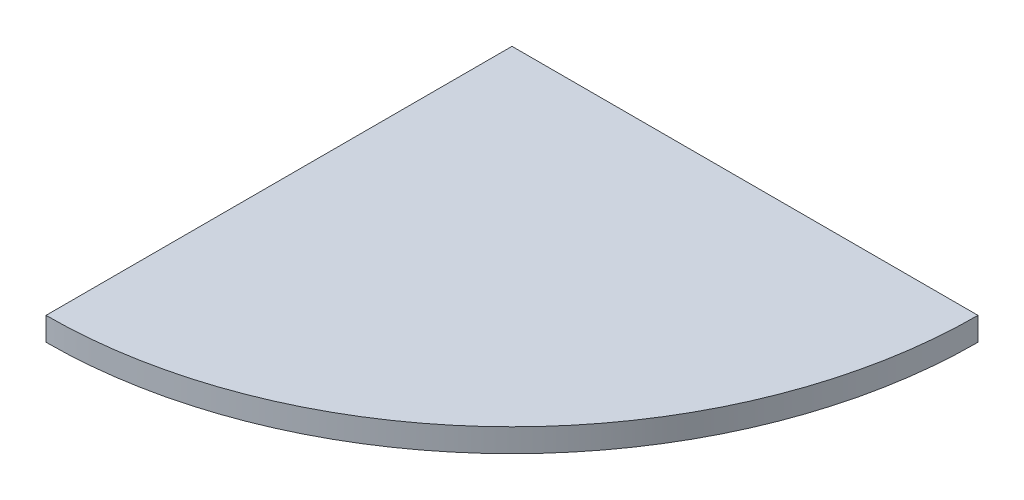
ISO-10303-21;
HEADER;
FILE_DESCRIPTION(('STEP AP214'),'2;1');
FILE_NAME('part.step','',(''),(''),'','','');
FILE_SCHEMA(('AUTOMOTIVE_DESIGN { 1 0 10303 214 1 1 1 1 }'));
ENDSEC;
DATA;
#1=APPLICATION_CONTEXT('core data for automotive mechanical design processes');
#2=APPLICATION_PROTOCOL_DEFINITION('international standard','automotive_design',2000,#1);
#3=PRODUCT_CONTEXT('',#1,'mechanical');
#4=PRODUCT('Part','Part','',(#3));
#5=PRODUCT_RELATED_PRODUCT_CATEGORY('part','',(#4));
#6=PRODUCT_DEFINITION_FORMATION('','',#4);
#7=PRODUCT_DEFINITION_CONTEXT('part definition',#1,'design');
#8=PRODUCT_DEFINITION('design','',#6,#7);
#9=PRODUCT_DEFINITION_SHAPE('','',#8);
#10=(LENGTH_UNIT() NAMED_UNIT(*) SI_UNIT(.MILLI.,.METRE.));
#11=(NAMED_UNIT(*) PLANE_ANGLE_UNIT() SI_UNIT($,.RADIAN.));
#12=(NAMED_UNIT(*) SI_UNIT($,.STERADIAN.) SOLID_ANGLE_UNIT());
#13=UNCERTAINTY_MEASURE_WITH_UNIT(LENGTH_MEASURE(1.E-05),#10,'distance_accuracy_value','');
#14=(GEOMETRIC_REPRESENTATION_CONTEXT(3) GLOBAL_UNCERTAINTY_ASSIGNED_CONTEXT((#13)) GLOBAL_UNIT_ASSIGNED_CONTEXT((#10,
#11,#12)) REPRESENTATION_CONTEXT('',''));
#15=CARTESIAN_POINT('',(0.,0.,0.));
#16=DIRECTION('',(0.,0.,1.));
#17=DIRECTION('',(1.,0.,0.));
#18=AXIS2_PLACEMENT_3D('',#15,#16,#17);
#19=CARTESIAN_POINT('',(0.,15.24,0.));
#20=DIRECTION('',(1.,0.,0.));
#21=DIRECTION('',(0.,0.,-1.));
#22=AXIS2_PLACEMENT_3D('',#19,#20,#21);
#23=PLANE('',#22);
#24=DIRECTION('',(0.,0.,1.));
#25=VECTOR('',#24,1.);
#26=CARTESIAN_POINT('',(0.,-15.24,0.));
#27=LINE('',#26,#25);
#28=CARTESIAN_POINT('',(0.,-15.24,0.));
#29=VERTEX_POINT('',#28);
#30=CARTESIAN_POINT('',(0.,-15.24,609.6));
#31=VERTEX_POINT('',#30);
#32=EDGE_CURVE('E93',#29,#31,#27,.T.);
#33=ORIENTED_EDGE('',*,*,#32,.T.);
#34=DIRECTION('',(0.,-1.,0.));
#35=VECTOR('',#34,1.);
#36=CARTESIAN_POINT('',(0.,15.24,609.6));
#37=LINE('',#36,#35);
#38=CARTESIAN_POINT('',(0.,15.24,609.6));
#39=VERTEX_POINT('',#38);
#40=EDGE_CURVE('E11',#39,#31,#37,.T.);
#41=ORIENTED_EDGE('',*,*,#40,.F.);
#42=DIRECTION('',(0.,0.,1.));
#43=VECTOR('',#42,1.);
#44=CARTESIAN_POINT('',(0.,15.24,0.));
#45=LINE('',#44,#43);
#46=CARTESIAN_POINT('',(0.,15.24,0.));
#47=VERTEX_POINT('',#46);
#48=EDGE_CURVE('E85',#47,#39,#45,.T.);
#49=ORIENTED_EDGE('',*,*,#48,.F.);
#50=DIRECTION('',(0.,-1.,0.));
#51=VECTOR('',#50,1.);
#52=CARTESIAN_POINT('',(0.,15.24,0.));
#53=LINE('',#52,#51);
#54=EDGE_CURVE('E94',#47,#29,#53,.T.);
#55=ORIENTED_EDGE('',*,*,#54,.T.);
#56=EDGE_LOOP('',(#33,#41,#49,#55));
#57=FACE_BOUND('',#56,.T.);
#58=ADVANCED_FACE('F43',(#57),#23,.F.);
#59=CARTESIAN_POINT('',(0.,15.24,0.));
#60=DIRECTION('',(0.,-1.,0.));
#61=DIRECTION('',(0.,0.,-1.));
#62=AXIS2_PLACEMENT_3D('',#59,#60,#61);
#63=CYLINDRICAL_SURFACE('',#62,609.6);
#64=CARTESIAN_POINT('',(0.,-15.24,0.));
#65=DIRECTION('',(0.,1.,0.));
#66=DIRECTION('',(0.,0.,1.));
#67=AXIS2_PLACEMENT_3D('',#64,#65,#66);
#68=CIRCLE('',#67,609.6);
#69=CARTESIAN_POINT('',(609.6,-15.24,0.));
#70=VERTEX_POINT('',#69);
#71=EDGE_CURVE('E72',#31,#70,#68,.T.);
#72=ORIENTED_EDGE('',*,*,#71,.T.);
#73=DIRECTION('',(0.,-1.,0.));
#74=VECTOR('',#73,1.);
#75=CARTESIAN_POINT('',(609.6,15.24,0.));
#76=LINE('',#75,#74);
#77=CARTESIAN_POINT('',(609.6,15.24,0.));
#78=VERTEX_POINT('',#77);
#79=EDGE_CURVE('E52',#78,#70,#76,.T.);
#80=ORIENTED_EDGE('',*,*,#79,.F.);
#81=CARTESIAN_POINT('',(0.,15.24,0.));
#82=DIRECTION('',(0.,1.,0.));
#83=DIRECTION('',(0.,0.,1.));
#84=AXIS2_PLACEMENT_3D('',#81,#82,#83);
#85=CIRCLE('',#84,609.6);
#86=EDGE_CURVE('E80',#39,#78,#85,.T.);
#87=ORIENTED_EDGE('',*,*,#86,.F.);
#88=ORIENTED_EDGE('',*,*,#40,.T.);
#89=EDGE_LOOP('',(#72,#80,#87,#88));
#90=FACE_BOUND('',#89,.T.);
#91=ADVANCED_FACE('F81',(#90),#63,.T.);
#92=CARTESIAN_POINT('',(0.,15.24,0.));
#93=DIRECTION('',(0.,0.,1.));
#94=DIRECTION('',(1.,0.,0.));
#95=AXIS2_PLACEMENT_3D('',#92,#93,#94);
#96=PLANE('',#95);
#97=DIRECTION('',(-1.,0.,0.));
#98=VECTOR('',#97,1.);
#99=CARTESIAN_POINT('',(0.,-15.24,0.));
#100=LINE('',#99,#98);
#101=EDGE_CURVE('E77',#70,#29,#100,.T.);
#102=ORIENTED_EDGE('',*,*,#101,.T.);
#103=ORIENTED_EDGE('',*,*,#54,.F.);
#104=DIRECTION('',(-1.,0.,0.));
#105=VECTOR('',#104,1.);
#106=CARTESIAN_POINT('',(0.,15.24,0.));
#107=LINE('',#106,#105);
#108=EDGE_CURVE('E60',#78,#47,#107,.T.);
#109=ORIENTED_EDGE('',*,*,#108,.F.);
#110=ORIENTED_EDGE('',*,*,#79,.T.);
#111=EDGE_LOOP('',(#102,#103,#109,#110));
#112=FACE_BOUND('',#111,.T.);
#113=ADVANCED_FACE('F106',(#112),#96,.F.);
#114=CARTESIAN_POINT('',(0.,15.24,0.));
#115=DIRECTION('',(0.,1.,0.));
#116=DIRECTION('',(0.,0.,1.));
#117=AXIS2_PLACEMENT_3D('',#114,#115,#116);
#118=PLANE('',#117);
#119=ORIENTED_EDGE('',*,*,#48,.T.);
#120=ORIENTED_EDGE('',*,*,#86,.T.);
#121=ORIENTED_EDGE('',*,*,#108,.T.);
#122=EDGE_LOOP('',(#119,#120,#121));
#123=FACE_BOUND('',#122,.T.);
#124=ADVANCED_FACE('F88',(#123),#118,.T.);
#125=CARTESIAN_POINT('',(0.,-15.24,0.));
#126=DIRECTION('',(0.,1.,0.));
#127=DIRECTION('',(0.,0.,1.));
#128=AXIS2_PLACEMENT_3D('',#125,#126,#127);
#129=PLANE('',#128);
#130=ORIENTED_EDGE('',*,*,#32,.F.);
#131=ORIENTED_EDGE('',*,*,#101,.F.);
#132=ORIENTED_EDGE('',*,*,#71,.F.);
#133=EDGE_LOOP('',(#130,#131,#132));
#134=FACE_BOUND('',#133,.T.);
#135=ADVANCED_FACE('F107',(#134),#129,.F.);
#136=CLOSED_SHELL('',(#58,#91,#113,#124,#135));
#137=MANIFOLD_SOLID_BREP('B2',#136);
#138=ADVANCED_BREP_SHAPE_REPRESENTATION('',(#18,#137),#14);
#139=SHAPE_DEFINITION_REPRESENTATION(#9,#138);
ENDSEC;
END-ISO-10303-21;
